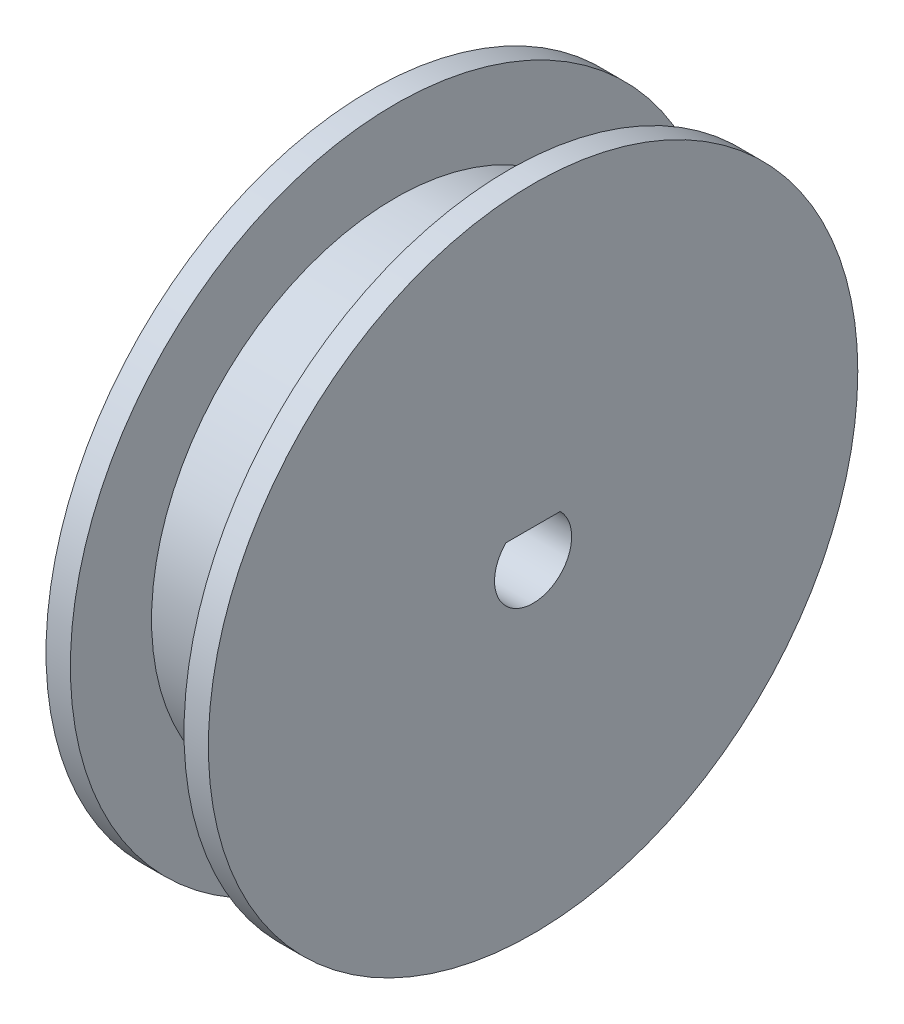
ISO-10303-21;
HEADER;
FILE_DESCRIPTION(('STEP AP214'),'2;1');
FILE_NAME('part.step','',(''),(''),'','','');
FILE_SCHEMA(('AUTOMOTIVE_DESIGN { 1 0 10303 214 1 1 1 1 }'));
ENDSEC;
DATA;
#1=APPLICATION_CONTEXT('core data for automotive mechanical design processes');
#2=APPLICATION_PROTOCOL_DEFINITION('international standard','automotive_design',2000,#1);
#3=PRODUCT_CONTEXT('',#1,'mechanical');
#4=PRODUCT('Part','Part','',(#3));
#5=PRODUCT_RELATED_PRODUCT_CATEGORY('part','',(#4));
#6=PRODUCT_DEFINITION_FORMATION('','',#4);
#7=PRODUCT_DEFINITION_CONTEXT('part definition',#1,'design');
#8=PRODUCT_DEFINITION('design','',#6,#7);
#9=PRODUCT_DEFINITION_SHAPE('','',#8);
#10=(LENGTH_UNIT() NAMED_UNIT(*) SI_UNIT(.MILLI.,.METRE.));
#11=(NAMED_UNIT(*) PLANE_ANGLE_UNIT() SI_UNIT($,.RADIAN.));
#12=(NAMED_UNIT(*) SI_UNIT($,.STERADIAN.) SOLID_ANGLE_UNIT());
#13=UNCERTAINTY_MEASURE_WITH_UNIT(LENGTH_MEASURE(1.E-05),#10,'distance_accuracy_value','');
#14=(GEOMETRIC_REPRESENTATION_CONTEXT(3) GLOBAL_UNCERTAINTY_ASSIGNED_CONTEXT((#13)) GLOBAL_UNIT_ASSIGNED_CONTEXT((#10,
#11,#12)) REPRESENTATION_CONTEXT('',''));
#15=CARTESIAN_POINT('',(0.,0.,0.));
#16=DIRECTION('',(0.,0.,1.));
#17=DIRECTION('',(1.,0.,0.));
#18=AXIS2_PLACEMENT_3D('',#15,#16,#17);
#19=CARTESIAN_POINT('',(-5.,0.,0.));
#20=DIRECTION('',(-1.,0.,0.));
#21=DIRECTION('',(0.,0.,1.));
#22=AXIS2_PLACEMENT_3D('',#19,#20,#21);
#23=PLANE('',#22);
#24=CARTESIAN_POINT('',(-5.,0.,0.));
#25=DIRECTION('',(1.,0.,0.));
#26=DIRECTION('',(0.,0.,-1.));
#27=AXIS2_PLACEMENT_3D('',#24,#25,#26);
#28=CIRCLE('',#27,20.);
#29=CARTESIAN_POINT('',(-5.,0.,-20.));
#30=VERTEX_POINT('',#29);
#31=EDGE_CURVE('E11',#30,#30,#28,.T.);
#32=ORIENTED_EDGE('',*,*,#31,.F.);
#33=EDGE_LOOP('',(#32));
#34=FACE_BOUND('',#33,.T.);
#35=CARTESIAN_POINT('',(-5.,0.,0.));
#36=DIRECTION('',(1.,0.,0.));
#37=DIRECTION('',(0.,0.,-1.));
#38=AXIS2_PLACEMENT_3D('',#35,#36,#37);
#39=CIRCLE('',#38,2.3749);
#40=CARTESIAN_POINT('',(-5.,1.68910825807584,1.66945));
#41=VERTEX_POINT('',#40);
#42=CARTESIAN_POINT('',(-5.,1.68910825807584,-1.66945));
#43=VERTEX_POINT('',#42);
#44=EDGE_CURVE('E76',#41,#43,#39,.T.);
#45=ORIENTED_EDGE('',*,*,#44,.T.);
#46=DIRECTION('',(0.,0.,-1.));
#47=VECTOR('',#46,1.);
#48=CARTESIAN_POINT('',(-5.,1.68910825807584,0.));
#49=LINE('',#48,#47);
#50=EDGE_CURVE('E63',#41,#43,#49,.T.);
#51=ORIENTED_EDGE('',*,*,#50,.F.);
#52=EDGE_LOOP('',(#45,#51));
#53=FACE_BOUND('',#52,.T.);
#54=ADVANCED_FACE('F35',(#34,#53),#23,.T.);
#55=CARTESIAN_POINT('',(5.,20.,0.));
#56=DIRECTION('',(1.,0.,0.));
#57=DIRECTION('',(0.,0.,-1.));
#58=AXIS2_PLACEMENT_3D('',#55,#56,#57);
#59=PLANE('',#58);
#60=CARTESIAN_POINT('',(5.,0.,0.));
#61=DIRECTION('',(1.,0.,0.));
#62=DIRECTION('',(0.,0.,-1.));
#63=AXIS2_PLACEMENT_3D('',#60,#61,#62);
#64=CIRCLE('',#63,20.);
#65=CARTESIAN_POINT('',(5.,0.,-20.));
#66=VERTEX_POINT('',#65);
#67=EDGE_CURVE('E65',#66,#66,#64,.T.);
#68=ORIENTED_EDGE('',*,*,#67,.T.);
#69=EDGE_LOOP('',(#68));
#70=FACE_BOUND('',#69,.T.);
#71=CARTESIAN_POINT('',(5.,0.,0.));
#72=DIRECTION('',(1.,0.,0.));
#73=DIRECTION('',(0.,0.,-1.));
#74=AXIS2_PLACEMENT_3D('',#71,#72,#73);
#75=CIRCLE('',#74,2.3749);
#76=CARTESIAN_POINT('',(5.,1.68910825807584,1.66945));
#77=VERTEX_POINT('',#76);
#78=CARTESIAN_POINT('',(5.,1.68910825807584,-1.66945));
#79=VERTEX_POINT('',#78);
#80=EDGE_CURVE('E69',#77,#79,#75,.T.);
#81=ORIENTED_EDGE('',*,*,#80,.F.);
#82=DIRECTION('',(0.,0.,-1.));
#83=VECTOR('',#82,1.);
#84=CARTESIAN_POINT('',(5.,1.68910825807584,0.));
#85=LINE('',#84,#83);
#86=EDGE_CURVE('E56',#77,#79,#85,.T.);
#87=ORIENTED_EDGE('',*,*,#86,.T.);
#88=EDGE_LOOP('',(#81,#87));
#89=FACE_BOUND('',#88,.T.);
#90=ADVANCED_FACE('F73',(#70,#89),#59,.T.);
#91=CARTESIAN_POINT('',(5.,0.,0.));
#92=DIRECTION('',(1.,0.,0.));
#93=DIRECTION('',(0.,0.,-1.));
#94=AXIS2_PLACEMENT_3D('',#91,#92,#93);
#95=CYLINDRICAL_SURFACE('',#94,20.);
#96=ORIENTED_EDGE('',*,*,#31,.T.);
#97=EDGE_LOOP('',(#96));
#98=FACE_BOUND('',#97,.T.);
#99=CARTESIAN_POINT('',(-3.5,0.,0.));
#100=DIRECTION('',(1.,0.,0.));
#101=DIRECTION('',(0.,0.,-1.));
#102=AXIS2_PLACEMENT_3D('',#99,#100,#101);
#103=CIRCLE('',#102,20.);
#104=CARTESIAN_POINT('',(-3.5,0.,-20.));
#105=VERTEX_POINT('',#104);
#106=EDGE_CURVE('E42',#105,#105,#103,.T.);
#107=ORIENTED_EDGE('',*,*,#106,.F.);
#108=EDGE_LOOP('',(#107));
#109=FACE_BOUND('',#108,.T.);
#110=ADVANCED_FACE('F96',(#98,#109),#95,.T.);
#111=CARTESIAN_POINT('',(-3.5,20.,0.));
#112=DIRECTION('',(1.,0.,0.));
#113=DIRECTION('',(0.,0.,-1.));
#114=AXIS2_PLACEMENT_3D('',#111,#112,#113);
#115=PLANE('',#114);
#116=ORIENTED_EDGE('',*,*,#106,.T.);
#117=EDGE_LOOP('',(#116));
#118=FACE_BOUND('',#117,.T.);
#119=CARTESIAN_POINT('',(-3.5,0.,0.));
#120=DIRECTION('',(1.,0.,0.));
#121=DIRECTION('',(0.,0.,-1.));
#122=AXIS2_PLACEMENT_3D('',#119,#120,#121);
#123=CIRCLE('',#122,15.);
#124=CARTESIAN_POINT('',(-3.5,0.,-15.));
#125=VERTEX_POINT('',#124);
#126=EDGE_CURVE('E88',#125,#125,#123,.T.);
#127=ORIENTED_EDGE('',*,*,#126,.F.);
#128=EDGE_LOOP('',(#127));
#129=FACE_BOUND('',#128,.T.);
#130=ADVANCED_FACE('F93',(#118,#129),#115,.T.);
#131=CARTESIAN_POINT('',(5.,0.,0.));
#132=DIRECTION('',(1.,0.,0.));
#133=DIRECTION('',(0.,0.,-1.));
#134=AXIS2_PLACEMENT_3D('',#131,#132,#133);
#135=CYLINDRICAL_SURFACE('',#134,15.);
#136=ORIENTED_EDGE('',*,*,#126,.T.);
#137=EDGE_LOOP('',(#136));
#138=FACE_BOUND('',#137,.T.);
#139=CARTESIAN_POINT('',(3.5,0.,0.));
#140=DIRECTION('',(1.,0.,0.));
#141=DIRECTION('',(0.,0.,-1.));
#142=AXIS2_PLACEMENT_3D('',#139,#140,#141);
#143=CIRCLE('',#142,15.);
#144=CARTESIAN_POINT('',(3.5,0.,-15.));
#145=VERTEX_POINT('',#144);
#146=EDGE_CURVE('E85',#145,#145,#143,.T.);
#147=ORIENTED_EDGE('',*,*,#146,.F.);
#148=EDGE_LOOP('',(#147));
#149=FACE_BOUND('',#148,.T.);
#150=ADVANCED_FACE('F103',(#138,#149),#135,.T.);
#151=CARTESIAN_POINT('',(3.5,15.,0.));
#152=DIRECTION('',(-1.,0.,0.));
#153=DIRECTION('',(0.,0.,1.));
#154=AXIS2_PLACEMENT_3D('',#151,#152,#153);
#155=PLANE('',#154);
#156=ORIENTED_EDGE('',*,*,#146,.T.);
#157=EDGE_LOOP('',(#156));
#158=FACE_BOUND('',#157,.T.);
#159=CARTESIAN_POINT('',(3.5,0.,0.));
#160=DIRECTION('',(1.,0.,0.));
#161=DIRECTION('',(0.,0.,-1.));
#162=AXIS2_PLACEMENT_3D('',#159,#160,#161);
#163=CIRCLE('',#162,20.);
#164=CARTESIAN_POINT('',(3.5,0.,-20.));
#165=VERTEX_POINT('',#164);
#166=EDGE_CURVE('E82',#165,#165,#163,.T.);
#167=ORIENTED_EDGE('',*,*,#166,.F.);
#168=EDGE_LOOP('',(#167));
#169=FACE_BOUND('',#168,.T.);
#170=ADVANCED_FACE('F143',(#158,#169),#155,.T.);
#171=CARTESIAN_POINT('',(5.,0.,0.));
#172=DIRECTION('',(1.,0.,0.));
#173=DIRECTION('',(0.,0.,-1.));
#174=AXIS2_PLACEMENT_3D('',#171,#172,#173);
#175=CYLINDRICAL_SURFACE('',#174,20.);
#176=ORIENTED_EDGE('',*,*,#166,.T.);
#177=EDGE_LOOP('',(#176));
#178=FACE_BOUND('',#177,.T.);
#179=ORIENTED_EDGE('',*,*,#67,.F.);
#180=EDGE_LOOP('',(#179));
#181=FACE_BOUND('',#180,.T.);
#182=ADVANCED_FACE('F128',(#178,#181),#175,.T.);
#183=CARTESIAN_POINT('',(-5.,1.68910825807584,0.));
#184=DIRECTION('',(0.,-1.,0.));
#185=DIRECTION('',(0.,0.,-1.));
#186=AXIS2_PLACEMENT_3D('',#183,#184,#185);
#187=PLANE('',#186);
#188=ORIENTED_EDGE('',*,*,#86,.F.);
#189=DIRECTION('',(1.,0.,0.));
#190=VECTOR('',#189,1.);
#191=CARTESIAN_POINT('',(-5.,1.68910825807584,1.66945));
#192=LINE('',#191,#190);
#193=EDGE_CURVE('E66',#41,#77,#192,.T.);
#194=ORIENTED_EDGE('',*,*,#193,.F.);
#195=ORIENTED_EDGE('',*,*,#50,.T.);
#196=DIRECTION('',(1.,0.,0.));
#197=VECTOR('',#196,1.);
#198=CARTESIAN_POINT('',(-5.,1.68910825807584,-1.66945));
#199=LINE('',#198,#197);
#200=EDGE_CURVE('E49',#43,#79,#199,.T.);
#201=ORIENTED_EDGE('',*,*,#200,.T.);
#202=EDGE_LOOP('',(#188,#194,#195,#201));
#203=FACE_BOUND('',#202,.T.);
#204=ADVANCED_FACE('F61',(#203),#187,.T.);
#205=CARTESIAN_POINT('',(-5.,0.,0.));
#206=DIRECTION('',(1.,0.,0.));
#207=DIRECTION('',(0.,0.,-1.));
#208=AXIS2_PLACEMENT_3D('',#205,#206,#207);
#209=CYLINDRICAL_SURFACE('',#208,2.3749);
#210=ORIENTED_EDGE('',*,*,#80,.T.);
#211=ORIENTED_EDGE('',*,*,#200,.F.);
#212=ORIENTED_EDGE('',*,*,#44,.F.);
#213=ORIENTED_EDGE('',*,*,#193,.T.);
#214=EDGE_LOOP('',(#210,#211,#212,#213));
#215=FACE_BOUND('',#214,.T.);
#216=ADVANCED_FACE('F70',(#215),#209,.F.);
#217=CLOSED_SHELL('',(#54,#90,#110,#130,#150,#170,#182,#204,#216));
#218=MANIFOLD_SOLID_BREP('B2',#217);
#219=ADVANCED_BREP_SHAPE_REPRESENTATION('',(#18,#218),#14);
#220=SHAPE_DEFINITION_REPRESENTATION(#9,#219);
ENDSEC;
END-ISO-10303-21;
